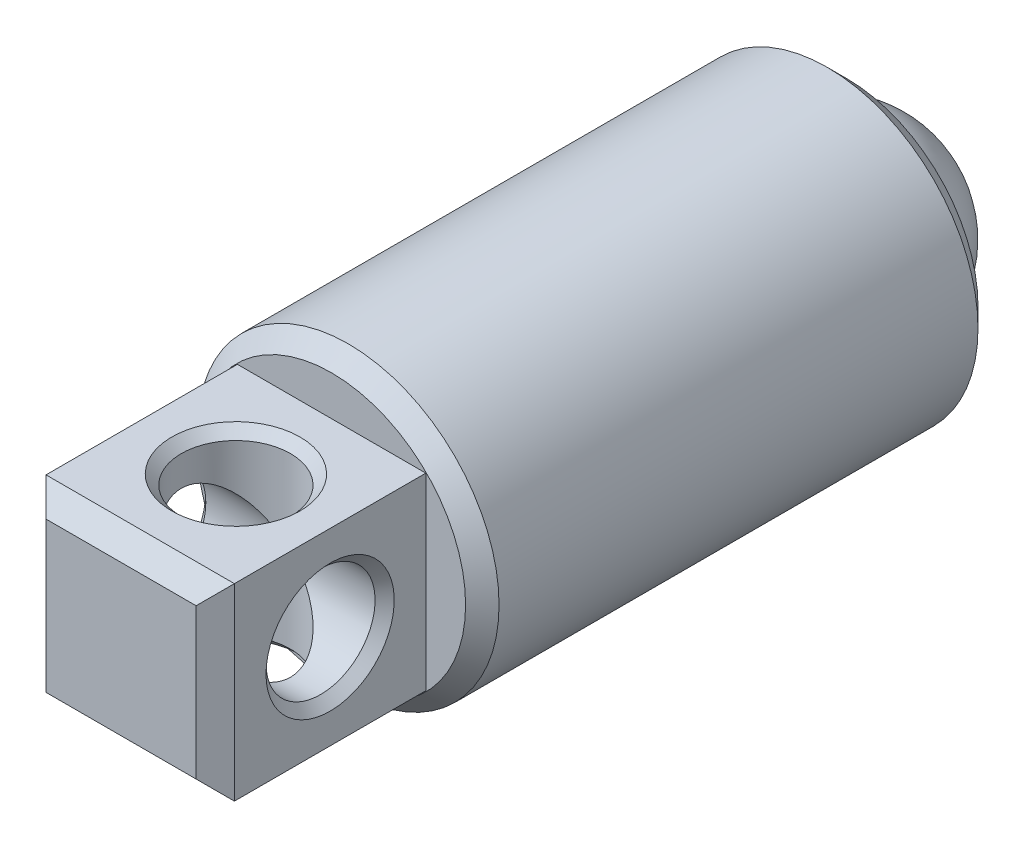
ISO-10303-21;
HEADER;
FILE_DESCRIPTION(('STEP AP214'),'2;1');
FILE_NAME('part.step','',(''),(''),'','','');
FILE_SCHEMA(('AUTOMOTIVE_DESIGN { 1 0 10303 214 1 1 1 1 }'));
ENDSEC;
DATA;
#1=APPLICATION_CONTEXT('core data for automotive mechanical design processes');
#2=APPLICATION_PROTOCOL_DEFINITION('international standard','automotive_design',2000,#1);
#3=PRODUCT_CONTEXT('',#1,'mechanical');
#4=PRODUCT('Part','Part','',(#3));
#5=PRODUCT_RELATED_PRODUCT_CATEGORY('part','',(#4));
#6=PRODUCT_DEFINITION_FORMATION('','',#4);
#7=PRODUCT_DEFINITION_CONTEXT('part definition',#1,'design');
#8=PRODUCT_DEFINITION('design','',#6,#7);
#9=PRODUCT_DEFINITION_SHAPE('','',#8);
#10=(LENGTH_UNIT() NAMED_UNIT(*) SI_UNIT(.MILLI.,.METRE.));
#11=(NAMED_UNIT(*) PLANE_ANGLE_UNIT() SI_UNIT($,.RADIAN.));
#12=(NAMED_UNIT(*) SI_UNIT($,.STERADIAN.) SOLID_ANGLE_UNIT());
#13=UNCERTAINTY_MEASURE_WITH_UNIT(LENGTH_MEASURE(1.E-05),#10,'distance_accuracy_value','');
#14=(GEOMETRIC_REPRESENTATION_CONTEXT(3) GLOBAL_UNCERTAINTY_ASSIGNED_CONTEXT((#13)) GLOBAL_UNIT_ASSIGNED_CONTEXT((#10,
#11,#12)) REPRESENTATION_CONTEXT('',''));
#15=CARTESIAN_POINT('',(0.,0.,0.));
#16=DIRECTION('',(0.,0.,1.));
#17=DIRECTION('',(1.,0.,0.));
#18=AXIS2_PLACEMENT_3D('',#15,#16,#17);
#19=CARTESIAN_POINT('',(1.6625129625254,-2.46036743646982,0.774114392898501));
#20=DIRECTION('',(-0.53244441493055,-0.84646496974728,0.));
#21=DIRECTION('',(0.84646496974728,-0.53244441493055,0.));
#22=AXIS2_PLACEMENT_3D('',#19,#20,#21);
#23=SPHERICAL_SURFACE('',#22,1.3890625);
#24=CARTESIAN_POINT('',(1.6625129625254,-2.46036743646982,0.774114392898501));
#25=DIRECTION('',(0.53244441493055,0.84646496974728,0.));
#26=DIRECTION('',(0.,0.,-1.));
#27=AXIS2_PLACEMENT_3D('',#24,#25,#26);
#28=CIRCLE('',#27,1.3890625);
#29=CARTESIAN_POINT('',(2.83830570956498,-3.19996600658429,0.774114392898501));
#30=VERTEX_POINT('',#29);
#31=CARTESIAN_POINT('',(0.486720215485815,-1.72076886635536,0.774114392898501));
#32=VERTEX_POINT('',#31);
#33=EDGE_CURVE('P0_E38',#30,#32,#28,.T.);
#34=ORIENTED_EDGE('',*,*,#33,.T.);
#35=CARTESIAN_POINT('',(1.6625129625254,-2.46036743646982,0.774114392898501));
#36=DIRECTION('',(0.,0.,-1.));
#37=DIRECTION('',(0.84646496974728,-0.53244441493055,0.));
#38=AXIS2_PLACEMENT_3D('',#35,#36,#37);
#39=CIRCLE('',#38,1.3890625);
#40=EDGE_CURVE('P0_E11',#32,#30,#39,.T.);
#41=ORIENTED_EDGE('',*,*,#40,.T.);
#42=EDGE_LOOP('',(#34,#41));
#43=FACE_BOUND('',#42,.T.);
#44=ADVANCED_FACE('P0_F16',(#43),#23,.T.);
#45=ORIENTED_EDGE('',*,*,#33,.F.);
#46=CARTESIAN_POINT('',(1.6625129625254,-2.46036743646982,0.774114392898501));
#47=DIRECTION('',(0.,0.,-1.));
#48=DIRECTION('',(0.84646496974728,-0.53244441493055,0.));
#49=AXIS2_PLACEMENT_3D('',#46,#47,#48);
#50=CIRCLE('',#49,1.3890625);
#51=EDGE_CURVE('P0_E23',#30,#32,#50,.T.);
#52=ORIENTED_EDGE('',*,*,#51,.T.);
#53=EDGE_LOOP('',(#45,#52));
#54=FACE_BOUND('',#53,.T.);
#55=ADVANCED_FACE('P0_F37',(#54),#23,.T.);
#56=ORIENTED_EDGE('',*,*,#40,.F.);
#57=EDGE_CURVE('P0_E34',#32,#30,#28,.T.);
#58=ORIENTED_EDGE('',*,*,#57,.T.);
#59=EDGE_LOOP('',(#56,#58));
#60=FACE_BOUND('',#59,.T.);
#61=ADVANCED_FACE('P0_F32',(#60),#23,.T.);
#62=ORIENTED_EDGE('',*,*,#51,.F.);
#63=ORIENTED_EDGE('',*,*,#57,.F.);
#64=EDGE_LOOP('',(#62,#63));
#65=FACE_BOUND('',#64,.T.);
#66=ADVANCED_FACE('P0_F18',(#65),#23,.T.);
#67=CLOSED_SHELL('',(#44,#55,#61,#66));
#68=MANIFOLD_SOLID_BREP('P0_B1',#67);
#69=CARTESIAN_POINT('',(-0.337483037474602,-2.46036743646982,8.6550518928985));
#70=DIRECTION('',(1.,0.,0.));
#71=DIRECTION('',(0.,0.,-1.));
#72=AXIS2_PLACEMENT_3D('',#69,#70,#71);
#73=CYLINDRICAL_SURFACE('',#72,0.7239);
#74=CARTESIAN_POINT('',(2.78551296252539,-2.46036743646982,8.6550518928985));
#75=DIRECTION('',(-1.,0.,0.));
#76=DIRECTION('',(0.,0.,1.));
#77=AXIS2_PLACEMENT_3D('',#74,#75,#76);
#78=CIRCLE('',#77,0.7239);
#79=CARTESIAN_POINT('',(2.78551296252539,-2.46036743646982,9.3789518928985));
#80=VERTEX_POINT('',#79);
#81=EDGE_CURVE('P1_E119',#80,#80,#78,.F.);
#82=ORIENTED_EDGE('',*,*,#81,.T.);
#83=EDGE_LOOP('',(#82));
#84=FACE_BOUND('',#83,.T.);
#85=CARTESIAN_POINT('',(1.6625129625254,-2.46036743646982,8.6550518928985));
#86=DIRECTION('',(0.707106781186547,-0.707106781186547,0.));
#87=DIRECTION('',(0.707106781186547,0.707106781186547,0.));
#88=AXIS2_PLACEMENT_3D('',#85,#86,#87);
#89=ELLIPSE('',#88,1.02374919780188,0.7239);
#90=CARTESIAN_POINT('',(1.6625129625254,-2.46036743646982,9.3789518928985));
#91=VERTEX_POINT('',#90);
#92=CARTESIAN_POINT('',(1.6625129625254,-2.46036743646982,7.9311518928985));
#93=VERTEX_POINT('',#92);
#94=EDGE_CURVE('P1_E86',#91,#93,#89,.F.);
#95=ORIENTED_EDGE('',*,*,#94,.T.);
#96=CARTESIAN_POINT('',(1.6625129625254,-2.46036743646982,8.6550518928985));
#97=DIRECTION('',(0.707106781186547,0.707106781186547,0.));
#98=DIRECTION('',(0.707106781186547,-0.707106781186547,0.));
#99=AXIS2_PLACEMENT_3D('',#96,#97,#98);
#100=ELLIPSE('',#99,1.02374919780188,0.7239);
#101=EDGE_CURVE('P1_E82',#93,#91,#100,.F.);
#102=ORIENTED_EDGE('',*,*,#101,.T.);
#103=EDGE_LOOP('',(#95,#102));
#104=FACE_BOUND('',#103,.T.);
#105=ADVANCED_FACE('P1_F15',(#84,#104),#73,.F.);
#106=CARTESIAN_POINT('',(1.6625129625254,-0.682367436469824,7.3850518928985));
#107=DIRECTION('',(0.,0.,-1.));
#108=DIRECTION('',(-1.,0.,0.));
#109=AXIS2_PLACEMENT_3D('',#106,#107,#108);
#110=PLANE('',#109);
#111=CARTESIAN_POINT('',(1.6625129625254,-2.46036743646982,7.3850518928985));
#112=DIRECTION('',(0.,0.,1.));
#113=DIRECTION('',(1.,0.,0.));
#114=AXIS2_PLACEMENT_3D('',#111,#112,#113);
#115=CIRCLE('',#114,1.778);
#116=CARTESIAN_POINT('',(3.4405129625254,-2.46036743646982,7.3850518928985));
#117=VERTEX_POINT('',#116);
#118=EDGE_CURVE('P1_E178',#117,#117,#115,.T.);
#119=ORIENTED_EDGE('',*,*,#118,.T.);
#120=EDGE_LOOP('',(#119));
#121=FACE_BOUND('',#120,.T.);
#122=DIRECTION('',(0.,1.,0.));
#123=VECTOR('',#122,1.);
#124=CARTESIAN_POINT('',(2.9125129625254,-3.71036743646982,7.3850518928985));
#125=LINE('',#124,#123);
#126=CARTESIAN_POINT('',(2.9125129625254,-3.71036743646982,7.3850518928985));
#127=VERTEX_POINT('',#126);
#128=CARTESIAN_POINT('',(2.9125129625254,-1.21036743646982,7.3850518928985));
#129=VERTEX_POINT('',#128);
#130=EDGE_CURVE('P1_E152',#127,#129,#125,.T.);
#131=ORIENTED_EDGE('',*,*,#130,.F.);
#132=DIRECTION('',(1.,0.,0.));
#133=VECTOR('',#132,1.);
#134=CARTESIAN_POINT('',(0.412512962525397,-3.71036743646982,7.3850518928985));
#135=LINE('',#134,#133);
#136=CARTESIAN_POINT('',(0.412512962525397,-3.71036743646982,7.3850518928985));
#137=VERTEX_POINT('',#136);
#138=EDGE_CURVE('P1_E167',#137,#127,#135,.T.);
#139=ORIENTED_EDGE('',*,*,#138,.F.);
#140=DIRECTION('',(0.,-1.,0.));
#141=VECTOR('',#140,1.);
#142=CARTESIAN_POINT('',(0.412512962525397,-3.71036743646982,7.3850518928985));
#143=LINE('',#142,#141);
#144=CARTESIAN_POINT('',(0.412512962525397,-1.21036743646982,7.3850518928985));
#145=VERTEX_POINT('',#144);
#146=EDGE_CURVE('P1_E162',#145,#137,#143,.T.);
#147=ORIENTED_EDGE('',*,*,#146,.F.);
#148=DIRECTION('',(-1.,0.,0.));
#149=VECTOR('',#148,1.);
#150=CARTESIAN_POINT('',(0.412512962525397,-1.21036743646982,7.3850518928985));
#151=LINE('',#150,#149);
#152=EDGE_CURVE('P1_E157',#129,#145,#151,.T.);
#153=ORIENTED_EDGE('',*,*,#152,.F.);
#154=EDGE_LOOP('',(#131,#139,#147,#153));
#155=FACE_BOUND('',#154,.T.);
#156=ADVANCED_FACE('P1_F195',(#121,#155),#110,.F.);
#157=CARTESIAN_POINT('',(1.6625129625254,-2.46036743646982,2.73854541938239));
#158=DIRECTION('',(0.,0.,-1.));
#159=DIRECTION('',(-1.,0.,0.));
#160=AXIS2_PLACEMENT_3D('',#157,#158,#159);
#161=CONICAL_SURFACE('',#160,0.,0.785398163397443);
#162=CARTESIAN_POINT('',(1.6625129625254,-2.46036743646982,1.34154541938237));
#163=DIRECTION('',(0.,0.,1.));
#164=DIRECTION('',(1.,0.,0.));
#165=AXIS2_PLACEMENT_3D('',#162,#163,#164);
#166=CIRCLE('',#165,1.397);
#167=CARTESIAN_POINT('',(3.0595129625254,-2.46036743646982,1.34154541938237));
#168=VERTEX_POINT('',#167);
#169=EDGE_CURVE('P1_E92',#168,#168,#166,.T.);
#170=ORIENTED_EDGE('',*,*,#169,.F.);
#171=EDGE_LOOP('',(#170));
#172=FACE_BOUND('',#171,.T.);
#173=CARTESIAN_POINT('',(1.6625129625254,-2.46036743646982,2.73854541938239));
#174=VERTEX_POINT('',#173);
#175=VERTEX_LOOP('',#174);
#176=FACE_BOUND('',#175,.T.);
#177=ADVANCED_FACE('P1_F192',(#172,#176),#161,.F.);
#178=CARTESIAN_POINT('',(1.6625129625254,-2.46036743646982,7.3850518928985));
#179=DIRECTION('',(0.,0.,1.));
#180=DIRECTION('',(1.,0.,0.));
#181=AXIS2_PLACEMENT_3D('',#178,#179,#180);
#182=CYLINDRICAL_SURFACE('',#181,1.397);
#183=CARTESIAN_POINT('',(1.6625129625254,-2.46036743646982,0.553451892898501));
#184=DIRECTION('',(0.,0.,1.));
#185=DIRECTION('',(1.,0.,0.));
#186=AXIS2_PLACEMENT_3D('',#183,#184,#185);
#187=CIRCLE('',#186,1.397);
#188=CARTESIAN_POINT('',(3.0595129625254,-2.46036743646982,0.553451892898501));
#189=VERTEX_POINT('',#188);
#190=EDGE_CURVE('P1_E184',#189,#189,#187,.T.);
#191=ORIENTED_EDGE('',*,*,#190,.F.);
#192=EDGE_LOOP('',(#191));
#193=FACE_BOUND('',#192,.T.);
#194=ORIENTED_EDGE('',*,*,#169,.T.);
#195=EDGE_LOOP('',(#194));
#196=FACE_BOUND('',#195,.T.);
#197=ADVANCED_FACE('P1_F190',(#193,#196),#182,.F.);
#198=CARTESIAN_POINT('',(1.6625129625254,-0.460371436469824,0.553451892898501));
#199=DIRECTION('',(0.,0.,1.));
#200=DIRECTION('',(1.,0.,0.));
#201=AXIS2_PLACEMENT_3D('',#198,#199,#200);
#202=PLANE('',#201);
#203=CARTESIAN_POINT('',(1.6625129625254,-2.46036743646982,0.553451892898501));
#204=DIRECTION('',(0.,0.,1.));
#205=DIRECTION('',(1.,0.,0.));
#206=AXIS2_PLACEMENT_3D('',#203,#204,#205);
#207=CIRCLE('',#206,1.745996);
#208=CARTESIAN_POINT('',(3.4085089625254,-2.46036743646982,0.553451892898501));
#209=VERTEX_POINT('',#208);
#210=EDGE_CURVE('P1_E101',#209,#209,#207,.F.);
#211=ORIENTED_EDGE('',*,*,#210,.T.);
#212=EDGE_LOOP('',(#211));
#213=FACE_BOUND('',#212,.T.);
#214=ORIENTED_EDGE('',*,*,#190,.T.);
#215=EDGE_LOOP('',(#214));
#216=FACE_BOUND('',#215,.T.);
#217=ADVANCED_FACE('P1_F202',(#213,#216),#202,.F.);
#218=CARTESIAN_POINT('',(1.6625129625254,-2.46036743646982,7.3850518928985));
#219=DIRECTION('',(0.,0.,1.));
#220=DIRECTION('',(1.,0.,0.));
#221=AXIS2_PLACEMENT_3D('',#218,#219,#220);
#222=CYLINDRICAL_SURFACE('',#221,1.999996);
#223=CARTESIAN_POINT('',(1.6625129625254,-2.46036743646982,0.807451892898501));
#224=DIRECTION('',(0.,0.,1.));
#225=DIRECTION('',(1.,0.,0.));
#226=AXIS2_PLACEMENT_3D('',#223,#224,#225);
#227=CIRCLE('',#226,1.999996);
#228=CARTESIAN_POINT('',(3.6625089625254,-2.46036743646982,0.807451892898501));
#229=VERTEX_POINT('',#228);
#230=EDGE_CURVE('P1_E94',#229,#229,#227,.T.);
#231=ORIENTED_EDGE('',*,*,#230,.T.);
#232=EDGE_LOOP('',(#231));
#233=FACE_BOUND('',#232,.T.);
#234=CARTESIAN_POINT('',(1.6625129625254,-2.46036743646982,7.1630558928985));
#235=DIRECTION('',(0.,0.,1.));
#236=DIRECTION('',(1.,0.,0.));
#237=AXIS2_PLACEMENT_3D('',#234,#235,#236);
#238=CIRCLE('',#237,1.999996);
#239=CARTESIAN_POINT('',(3.6625089625254,-2.46036743646982,7.1630558928985));
#240=VERTEX_POINT('',#239);
#241=EDGE_CURVE('P1_E181',#240,#240,#238,.T.);
#242=ORIENTED_EDGE('',*,*,#241,.F.);
#243=EDGE_LOOP('',(#242));
#244=FACE_BOUND('',#243,.T.);
#245=ADVANCED_FACE('P1_F285',(#233,#244),#222,.T.);
#246=CARTESIAN_POINT('',(1.6625129625254,-2.46036743646982,7.1630558928985));
#247=DIRECTION('',(0.,0.,-1.));
#248=DIRECTION('',(-1.,0.,0.));
#249=AXIS2_PLACEMENT_3D('',#246,#247,#248);
#250=CONICAL_SURFACE('',#249,1.999996,0.78539816339745);
#251=ORIENTED_EDGE('',*,*,#118,.F.);
#252=EDGE_LOOP('',(#251));
#253=FACE_BOUND('',#252,.T.);
#254=ORIENTED_EDGE('',*,*,#241,.T.);
#255=EDGE_LOOP('',(#254));
#256=FACE_BOUND('',#255,.T.);
#257=ADVANCED_FACE('P1_F288',(#253,#256),#250,.T.);
#258=CARTESIAN_POINT('',(2.9125129625254,-3.71036743646982,10.1790518928985));
#259=DIRECTION('',(-1.,0.,0.));
#260=DIRECTION('',(0.,0.,1.));
#261=AXIS2_PLACEMENT_3D('',#258,#259,#260);
#262=PLANE('',#261);
#263=CARTESIAN_POINT('',(2.9125129625254,-2.46036743646982,8.6550518928985));
#264=DIRECTION('',(-1.,0.,0.));
#265=DIRECTION('',(0.,0.,1.));
#266=AXIS2_PLACEMENT_3D('',#263,#264,#265);
#267=CIRCLE('',#266,0.850900000000003);
#268=CARTESIAN_POINT('',(2.9125129625254,-2.46036743646982,9.5059518928985));
#269=VERTEX_POINT('',#268);
#270=EDGE_CURVE('P1_E116',#269,#269,#267,.T.);
#271=ORIENTED_EDGE('',*,*,#270,.T.);
#272=EDGE_LOOP('',(#271));
#273=FACE_BOUND('',#272,.T.);
#274=DIRECTION('',(0.,0.,-1.));
#275=VECTOR('',#274,1.);
#276=CARTESIAN_POINT('',(2.9125129625254,-1.21036743646982,10.1790518928985));
#277=LINE('',#276,#275);
#278=CARTESIAN_POINT('',(2.9125129625254,-1.21036743646982,9.9250518928985));
#279=VERTEX_POINT('',#278);
#280=EDGE_CURVE('P1_E176',#279,#129,#277,.T.);
#281=ORIENTED_EDGE('',*,*,#280,.F.);
#282=DIRECTION('',(0.,-1.,0.));
#283=VECTOR('',#282,1.);
#284=CARTESIAN_POINT('',(2.9125129625254,-3.71036743646982,9.9250518928985));
#285=LINE('',#284,#283);
#286=CARTESIAN_POINT('',(2.9125129625254,-3.71036743646982,9.9250518928985));
#287=VERTEX_POINT('',#286);
#288=EDGE_CURVE('P1_E10',#279,#287,#285,.T.);
#289=ORIENTED_EDGE('',*,*,#288,.T.);
#290=DIRECTION('',(0.,0.,-1.));
#291=VECTOR('',#290,1.);
#292=CARTESIAN_POINT('',(2.9125129625254,-3.71036743646982,10.1790518928985));
#293=LINE('',#292,#291);
#294=EDGE_CURVE('P1_E170',#287,#127,#293,.T.);
#295=ORIENTED_EDGE('',*,*,#294,.T.);
#296=ORIENTED_EDGE('',*,*,#130,.T.);
#297=EDGE_LOOP('',(#281,#289,#295,#296));
#298=FACE_BOUND('',#297,.T.);
#299=ADVANCED_FACE('P1_F245',(#273,#298),#262,.F.);
#300=CARTESIAN_POINT('',(0.412512962525397,-1.21036743646982,10.1790518928985));
#301=DIRECTION('',(0.,-1.,0.));
#302=DIRECTION('',(0.,0.,-1.));
#303=AXIS2_PLACEMENT_3D('',#300,#301,#302);
#304=PLANE('',#303);
#305=CARTESIAN_POINT('',(1.6625129625254,-1.21036743646982,8.6550518928985));
#306=DIRECTION('',(0.,-1.,0.));
#307=DIRECTION('',(0.,0.,-1.));
#308=AXIS2_PLACEMENT_3D('',#305,#306,#307);
#309=CIRCLE('',#308,0.850900000000001);
#310=CARTESIAN_POINT('',(1.6625129625254,-1.21036743646982,7.8041518928985));
#311=VERTEX_POINT('',#310);
#312=EDGE_CURVE('P1_E122',#311,#311,#309,.T.);
#313=ORIENTED_EDGE('',*,*,#312,.T.);
#314=EDGE_LOOP('',(#313));
#315=FACE_BOUND('',#314,.T.);
#316=DIRECTION('',(0.,0.,-1.));
#317=VECTOR('',#316,1.);
#318=CARTESIAN_POINT('',(0.412512962525397,-1.21036743646982,10.1790518928985));
#319=LINE('',#318,#317);
#320=CARTESIAN_POINT('',(0.412512962525397,-1.21036743646982,9.9250518928985));
#321=VERTEX_POINT('',#320);
#322=EDGE_CURVE('P1_E174',#321,#145,#319,.T.);
#323=ORIENTED_EDGE('',*,*,#322,.F.);
#324=DIRECTION('',(1.,0.,0.));
#325=VECTOR('',#324,1.);
#326=CARTESIAN_POINT('',(0.412512962525397,-1.21036743646982,9.9250518928985));
#327=LINE('',#326,#325);
#328=EDGE_CURVE('P1_E24',#321,#279,#327,.T.);
#329=ORIENTED_EDGE('',*,*,#328,.T.);
#330=ORIENTED_EDGE('',*,*,#280,.T.);
#331=ORIENTED_EDGE('',*,*,#152,.T.);
#332=EDGE_LOOP('',(#323,#329,#330,#331));
#333=FACE_BOUND('',#332,.T.);
#334=ADVANCED_FACE('P1_F236',(#315,#333),#304,.F.);
#335=CARTESIAN_POINT('',(0.412512962525397,-3.71036743646982,10.1790518928985));
#336=DIRECTION('',(1.,0.,0.));
#337=DIRECTION('',(0.,0.,-1.));
#338=AXIS2_PLACEMENT_3D('',#335,#336,#337);
#339=PLANE('',#338);
#340=CARTESIAN_POINT('',(0.412512962525397,-2.46036743646982,8.6550518928985));
#341=DIRECTION('',(1.,0.,0.));
#342=DIRECTION('',(0.,0.,-1.));
#343=AXIS2_PLACEMENT_3D('',#340,#341,#342);
#344=CIRCLE('',#343,0.850900000000001);
#345=CARTESIAN_POINT('',(0.412512962525397,-2.46036743646982,7.8041518928985));
#346=VERTEX_POINT('',#345);
#347=EDGE_CURVE('P1_E104',#346,#346,#344,.T.);
#348=ORIENTED_EDGE('',*,*,#347,.T.);
#349=EDGE_LOOP('',(#348));
#350=FACE_BOUND('',#349,.T.);
#351=DIRECTION('',(0.,0.,-1.));
#352=VECTOR('',#351,1.);
#353=CARTESIAN_POINT('',(0.412512962525397,-3.71036743646982,10.1790518928985));
#354=LINE('',#353,#352);
#355=CARTESIAN_POINT('',(0.412512962525397,-3.71036743646982,9.9250518928985));
#356=VERTEX_POINT('',#355);
#357=EDGE_CURVE('P1_E172',#356,#137,#354,.T.);
#358=ORIENTED_EDGE('',*,*,#357,.F.);
#359=DIRECTION('',(0.,1.,0.));
#360=VECTOR('',#359,1.);
#361=CARTESIAN_POINT('',(0.412512962525397,-3.71036743646982,9.9250518928985));
#362=LINE('',#361,#360);
#363=EDGE_CURVE('P1_E39',#356,#321,#362,.T.);
#364=ORIENTED_EDGE('',*,*,#363,.T.);
#365=ORIENTED_EDGE('',*,*,#322,.T.);
#366=ORIENTED_EDGE('',*,*,#146,.T.);
#367=EDGE_LOOP('',(#358,#364,#365,#366));
#368=FACE_BOUND('',#367,.T.);
#369=ADVANCED_FACE('P1_F234',(#350,#368),#339,.F.);
#370=CARTESIAN_POINT('',(0.412512962525397,-3.71036743646982,10.1790518928985));
#371=DIRECTION('',(0.,1.,0.));
#372=DIRECTION('',(0.,0.,1.));
#373=AXIS2_PLACEMENT_3D('',#370,#371,#372);
#374=PLANE('',#373);
#375=CARTESIAN_POINT('',(1.6625129625254,-3.71036743646982,8.6550518928985));
#376=DIRECTION('',(0.,1.,0.));
#377=DIRECTION('',(0.,0.,1.));
#378=AXIS2_PLACEMENT_3D('',#375,#376,#377);
#379=CIRCLE('',#378,0.850900000000003);
#380=CARTESIAN_POINT('',(1.6625129625254,-3.71036743646982,9.5059518928985));
#381=VERTEX_POINT('',#380);
#382=EDGE_CURVE('P1_E110',#381,#381,#379,.T.);
#383=ORIENTED_EDGE('',*,*,#382,.T.);
#384=EDGE_LOOP('',(#383));
#385=FACE_BOUND('',#384,.T.);
#386=ORIENTED_EDGE('',*,*,#294,.F.);
#387=DIRECTION('',(-1.,0.,0.));
#388=VECTOR('',#387,1.);
#389=CARTESIAN_POINT('',(0.412512962525397,-3.71036743646982,9.9250518928985));
#390=LINE('',#389,#388);
#391=EDGE_CURVE('P1_E137',#287,#356,#390,.T.);
#392=ORIENTED_EDGE('',*,*,#391,.T.);
#393=ORIENTED_EDGE('',*,*,#357,.T.);
#394=ORIENTED_EDGE('',*,*,#138,.T.);
#395=EDGE_LOOP('',(#386,#392,#393,#394));
#396=FACE_BOUND('',#395,.T.);
#397=ADVANCED_FACE('P1_F222',(#385,#396),#374,.F.);
#398=CARTESIAN_POINT('',(1.6625129625254,-2.46036743646982,10.1790518928985));
#399=DIRECTION('',(0.,0.,-1.));
#400=DIRECTION('',(-1.,0.,0.));
#401=AXIS2_PLACEMENT_3D('',#398,#399,#400);
#402=PLANE('',#401);
#403=DIRECTION('',(0.,-1.,0.));
#404=VECTOR('',#403,1.);
#405=CARTESIAN_POINT('',(0.666512962525396,-2.46036743646982,10.1790518928985));
#406=LINE('',#405,#404);
#407=CARTESIAN_POINT('',(0.666512962525396,-1.46436743646982,10.1790518928985));
#408=VERTEX_POINT('',#407);
#409=CARTESIAN_POINT('',(0.666512962525396,-3.45636743646982,10.1790518928985));
#410=VERTEX_POINT('',#409);
#411=EDGE_CURVE('P1_E132',#408,#410,#406,.T.);
#412=ORIENTED_EDGE('',*,*,#411,.T.);
#413=DIRECTION('',(1.,0.,0.));
#414=VECTOR('',#413,1.);
#415=CARTESIAN_POINT('',(1.6625129625254,-3.45636743646982,10.1790518928985));
#416=LINE('',#415,#414);
#417=CARTESIAN_POINT('',(2.6585129625254,-3.45636743646982,10.1790518928985));
#418=VERTEX_POINT('',#417);
#419=EDGE_CURVE('P1_E134',#410,#418,#416,.T.);
#420=ORIENTED_EDGE('',*,*,#419,.T.);
#421=DIRECTION('',(0.,1.,0.));
#422=VECTOR('',#421,1.);
#423=CARTESIAN_POINT('',(2.6585129625254,-2.46036743646982,10.1790518928985));
#424=LINE('',#423,#422);
#425=CARTESIAN_POINT('',(2.6585129625254,-1.46436743646982,10.1790518928985));
#426=VERTEX_POINT('',#425);
#427=EDGE_CURVE('P1_E128',#418,#426,#424,.T.);
#428=ORIENTED_EDGE('',*,*,#427,.T.);
#429=DIRECTION('',(-1.,0.,0.));
#430=VECTOR('',#429,1.);
#431=CARTESIAN_POINT('',(1.6625129625254,-1.46436743646982,10.1790518928985));
#432=LINE('',#431,#430);
#433=EDGE_CURVE('P1_E130',#426,#408,#432,.T.);
#434=ORIENTED_EDGE('',*,*,#433,.T.);
#435=EDGE_LOOP('',(#412,#420,#428,#434));
#436=FACE_BOUND('',#435,.T.);
#437=ADVANCED_FACE('P1_F215',(#436),#402,.F.);
#438=CARTESIAN_POINT('',(0.539512962525399,-2.46036743646982,8.6550518928985));
#439=DIRECTION('',(1.,0.,0.));
#440=DIRECTION('',(0.,0.,-1.));
#441=AXIS2_PLACEMENT_3D('',#438,#439,#440);
#442=CIRCLE('',#441,0.7239);
#443=CARTESIAN_POINT('',(0.539512962525399,-2.46036743646982,7.9311518928985));
#444=VERTEX_POINT('',#443);
#445=EDGE_CURVE('P1_E107',#444,#444,#442,.F.);
#446=ORIENTED_EDGE('',*,*,#445,.T.);
#447=EDGE_LOOP('',(#446));
#448=FACE_BOUND('',#447,.T.);
#449=CARTESIAN_POINT('',(1.6625129625254,-2.46036743646982,8.6550518928985));
#450=DIRECTION('',(0.707106781186547,-0.707106781186547,0.));
#451=DIRECTION('',(0.707106781186547,0.707106781186547,0.));
#452=AXIS2_PLACEMENT_3D('',#449,#450,#451);
#453=ELLIPSE('',#452,1.02374919780188,0.7239);
#454=EDGE_CURVE('P1_E78',#91,#93,#453,.T.);
#455=ORIENTED_EDGE('',*,*,#454,.T.);
#456=CARTESIAN_POINT('',(1.6625129625254,-2.46036743646982,8.6550518928985));
#457=DIRECTION('',(0.707106781186547,0.707106781186547,0.));
#458=DIRECTION('',(0.707106781186547,-0.707106781186547,0.));
#459=AXIS2_PLACEMENT_3D('',#456,#457,#458);
#460=ELLIPSE('',#459,1.02374919780188,0.7239);
#461=EDGE_CURVE('P1_E85',#93,#91,#460,.T.);
#462=ORIENTED_EDGE('',*,*,#461,.T.);
#463=EDGE_LOOP('',(#455,#462));
#464=FACE_BOUND('',#463,.T.);
#465=ADVANCED_FACE('P1_F96',(#448,#464),#73,.F.);
#466=CARTESIAN_POINT('',(1.6625129625254,-4.46036343646982,8.6550518928985));
#467=DIRECTION('',(0.,1.,0.));
#468=DIRECTION('',(0.,0.,1.));
#469=AXIS2_PLACEMENT_3D('',#466,#467,#468);
#470=CYLINDRICAL_SURFACE('',#469,0.7239);
#471=CARTESIAN_POINT('',(1.6625129625254,-1.33736743646982,8.6550518928985));
#472=DIRECTION('',(0.,-1.,0.));
#473=DIRECTION('',(0.,0.,-1.));
#474=AXIS2_PLACEMENT_3D('',#471,#472,#473);
#475=CIRCLE('',#474,0.7239);
#476=CARTESIAN_POINT('',(1.6625129625254,-1.33736743646982,7.9311518928985));
#477=VERTEX_POINT('',#476);
#478=EDGE_CURVE('P1_E125',#477,#477,#475,.F.);
#479=ORIENTED_EDGE('',*,*,#478,.T.);
#480=EDGE_LOOP('',(#479));
#481=FACE_BOUND('',#480,.T.);
#482=ORIENTED_EDGE('',*,*,#94,.F.);
#483=ORIENTED_EDGE('',*,*,#461,.F.);
#484=EDGE_LOOP('',(#482,#483));
#485=FACE_BOUND('',#484,.T.);
#486=ADVANCED_FACE('P1_F90',(#481,#485),#470,.F.);
#487=CARTESIAN_POINT('',(1.6625129625254,-3.58336743646982,8.6550518928985));
#488=DIRECTION('',(0.,1.,0.));
#489=DIRECTION('',(0.,0.,1.));
#490=AXIS2_PLACEMENT_3D('',#487,#488,#489);
#491=CIRCLE('',#490,0.7239);
#492=CARTESIAN_POINT('',(1.6625129625254,-3.58336743646982,9.3789518928985));
#493=VERTEX_POINT('',#492);
#494=EDGE_CURVE('P1_E113',#493,#493,#491,.F.);
#495=ORIENTED_EDGE('',*,*,#494,.T.);
#496=EDGE_LOOP('',(#495));
#497=FACE_BOUND('',#496,.T.);
#498=ORIENTED_EDGE('',*,*,#454,.F.);
#499=ORIENTED_EDGE('',*,*,#101,.F.);
#500=EDGE_LOOP('',(#498,#499));
#501=FACE_BOUND('',#500,.T.);
#502=ADVANCED_FACE('P1_F80',(#497,#501),#470,.F.);
#503=CARTESIAN_POINT('',(1.6625129625254,-2.46036743646982,0.807451892898501));
#504=DIRECTION('',(0.,0.,1.));
#505=DIRECTION('',(1.,0.,0.));
#506=AXIS2_PLACEMENT_3D('',#503,#504,#505);
#507=CONICAL_SURFACE('',#506,1.999996,0.785398163397446);
#508=ORIENTED_EDGE('',*,*,#210,.F.);
#509=EDGE_LOOP('',(#508));
#510=FACE_BOUND('',#509,.T.);
#511=ORIENTED_EDGE('',*,*,#230,.F.);
#512=EDGE_LOOP('',(#511));
#513=FACE_BOUND('',#512,.T.);
#514=ADVANCED_FACE('P1_F230',(#510,#513),#507,.T.);
#515=CARTESIAN_POINT('',(0.412512962525397,-2.46036743646982,8.6550518928985));
#516=DIRECTION('',(-1.,0.,0.));
#517=DIRECTION('',(0.,0.,1.));
#518=AXIS2_PLACEMENT_3D('',#515,#516,#517);
#519=CONICAL_SURFACE('',#518,0.850900000000001,0.785398163397444);
#520=ORIENTED_EDGE('',*,*,#445,.F.);
#521=EDGE_LOOP('',(#520));
#522=FACE_BOUND('',#521,.T.);
#523=ORIENTED_EDGE('',*,*,#347,.F.);
#524=EDGE_LOOP('',(#523));
#525=FACE_BOUND('',#524,.T.);
#526=ADVANCED_FACE('P1_F226',(#522,#525),#519,.F.);
#527=CARTESIAN_POINT('',(1.6625129625254,-3.71036743646982,8.6550518928985));
#528=DIRECTION('',(0.,-1.,0.));
#529=DIRECTION('',(0.,0.,-1.));
#530=AXIS2_PLACEMENT_3D('',#527,#528,#529);
#531=CONICAL_SURFACE('',#530,0.850900000000003,0.785398163397445);
#532=ORIENTED_EDGE('',*,*,#494,.F.);
#533=EDGE_LOOP('',(#532));
#534=FACE_BOUND('',#533,.T.);
#535=ORIENTED_EDGE('',*,*,#382,.F.);
#536=EDGE_LOOP('',(#535));
#537=FACE_BOUND('',#536,.T.);
#538=ADVANCED_FACE('P1_F229',(#534,#537),#531,.F.);
#539=CARTESIAN_POINT('',(2.9125129625254,-2.46036743646982,8.6550518928985));
#540=DIRECTION('',(1.,0.,0.));
#541=DIRECTION('',(0.,0.,-1.));
#542=AXIS2_PLACEMENT_3D('',#539,#540,#541);
#543=CONICAL_SURFACE('',#542,0.850900000000003,0.785398163397444);
#544=ORIENTED_EDGE('',*,*,#81,.F.);
#545=EDGE_LOOP('',(#544));
#546=FACE_BOUND('',#545,.T.);
#547=ORIENTED_EDGE('',*,*,#270,.F.);
#548=EDGE_LOOP('',(#547));
#549=FACE_BOUND('',#548,.T.);
#550=ADVANCED_FACE('P1_F267',(#546,#549),#543,.F.);
#551=CARTESIAN_POINT('',(1.6625129625254,-1.21036743646982,8.6550518928985));
#552=DIRECTION('',(0.,1.,0.));
#553=DIRECTION('',(0.,0.,1.));
#554=AXIS2_PLACEMENT_3D('',#551,#552,#553);
#555=CONICAL_SURFACE('',#554,0.850900000000001,0.785398163397445);
#556=ORIENTED_EDGE('',*,*,#478,.F.);
#557=EDGE_LOOP('',(#556));
#558=FACE_BOUND('',#557,.T.);
#559=ORIENTED_EDGE('',*,*,#312,.F.);
#560=EDGE_LOOP('',(#559));
#561=FACE_BOUND('',#560,.T.);
#562=ADVANCED_FACE('P1_F261',(#558,#561),#555,.F.);
#563=CARTESIAN_POINT('',(1.6625129625254,-1.46436743646982,10.1790518928985));
#564=DIRECTION('',(0.,-0.707106781186548,-0.707106781186548));
#565=DIRECTION('',(-1.,0.,0.));
#566=AXIS2_PLACEMENT_3D('',#563,#564,#565);
#567=PLANE('',#566);
#568=DIRECTION('',(-0.577350269189626,-0.577350269189626,0.577350269189626));
#569=VECTOR('',#568,1.);
#570=CARTESIAN_POINT('',(2.3265129625254,-1.79636743646982,10.5110518928985));
#571=LINE('',#570,#569);
#572=EDGE_CURVE('P1_E145',#279,#426,#571,.T.);
#573=ORIENTED_EDGE('',*,*,#572,.F.);
#574=ORIENTED_EDGE('',*,*,#328,.F.);
#575=DIRECTION('',(0.577350269189626,-0.577350269189626,0.577350269189626));
#576=VECTOR('',#575,1.);
#577=CARTESIAN_POINT('',(0.998512962525397,-1.79636743646982,10.5110518928985));
#578=LINE('',#577,#576);
#579=EDGE_CURVE('P1_E19',#408,#321,#578,.F.);
#580=ORIENTED_EDGE('',*,*,#579,.F.);
#581=ORIENTED_EDGE('',*,*,#433,.F.);
#582=EDGE_LOOP('',(#573,#574,#580,#581));
#583=FACE_BOUND('',#582,.T.);
#584=ADVANCED_FACE('P1_F17',(#583),#567,.F.);
#585=CARTESIAN_POINT('',(0.666512962525396,-2.46036743646982,10.1790518928985));
#586=DIRECTION('',(0.707106781186548,0.,-0.707106781186548));
#587=DIRECTION('',(0.,-1.,0.));
#588=AXIS2_PLACEMENT_3D('',#585,#586,#587);
#589=PLANE('',#588);
#590=ORIENTED_EDGE('',*,*,#579,.T.);
#591=ORIENTED_EDGE('',*,*,#363,.F.);
#592=DIRECTION('',(0.577350269189626,0.577350269189626,0.577350269189626));
#593=VECTOR('',#592,1.);
#594=CARTESIAN_POINT('',(0.998512962525396,-3.12436743646982,10.5110518928985));
#595=LINE('',#594,#593);
#596=EDGE_CURVE('P1_E144',#410,#356,#595,.F.);
#597=ORIENTED_EDGE('',*,*,#596,.F.);
#598=ORIENTED_EDGE('',*,*,#411,.F.);
#599=EDGE_LOOP('',(#590,#591,#597,#598));
#600=FACE_BOUND('',#599,.T.);
#601=ADVANCED_FACE('P1_F254',(#600),#589,.F.);
#602=CARTESIAN_POINT('',(2.6585129625254,-2.46036743646982,10.1790518928985));
#603=DIRECTION('',(-0.707106781186548,0.,-0.707106781186548));
#604=DIRECTION('',(0.,1.,0.));
#605=AXIS2_PLACEMENT_3D('',#602,#603,#604);
#606=PLANE('',#605);
#607=ORIENTED_EDGE('',*,*,#572,.T.);
#608=ORIENTED_EDGE('',*,*,#427,.F.);
#609=DIRECTION('',(0.577350269189626,-0.577350269189626,-0.577350269189626));
#610=VECTOR('',#609,1.);
#611=CARTESIAN_POINT('',(2.3265129625254,-3.12436743646982,10.5110518928985));
#612=LINE('',#611,#610);
#613=EDGE_CURVE('P1_E142',#287,#418,#612,.F.);
#614=ORIENTED_EDGE('',*,*,#613,.F.);
#615=ORIENTED_EDGE('',*,*,#288,.F.);
#616=EDGE_LOOP('',(#607,#608,#614,#615));
#617=FACE_BOUND('',#616,.T.);
#618=ADVANCED_FACE('P1_F249',(#617),#606,.F.);
#619=CARTESIAN_POINT('',(1.6625129625254,-3.45636743646982,10.1790518928985));
#620=DIRECTION('',(0.,0.707106781186548,-0.707106781186548));
#621=DIRECTION('',(1.,0.,0.));
#622=AXIS2_PLACEMENT_3D('',#619,#620,#621);
#623=PLANE('',#622);
#624=ORIENTED_EDGE('',*,*,#596,.T.);
#625=ORIENTED_EDGE('',*,*,#391,.F.);
#626=ORIENTED_EDGE('',*,*,#613,.T.);
#627=ORIENTED_EDGE('',*,*,#419,.F.);
#628=EDGE_LOOP('',(#624,#625,#626,#627));
#629=FACE_BOUND('',#628,.T.);
#630=ADVANCED_FACE('P1_F252',(#629),#623,.F.);
#631=CLOSED_SHELL('',(#105,#156,#177,#197,#217,#245,#257,#299,#334,#369,#397,#437,#465,#486,
#502,#514,#526,#538,#550,#562,#584,#601,#618,#630));
#632=MANIFOLD_SOLID_BREP('P1_B1',#631);
#633=ADVANCED_BREP_SHAPE_REPRESENTATION('',(#18,#68,#632),#14);
#634=SHAPE_DEFINITION_REPRESENTATION(#9,#633);
ENDSEC;
END-ISO-10303-21;
